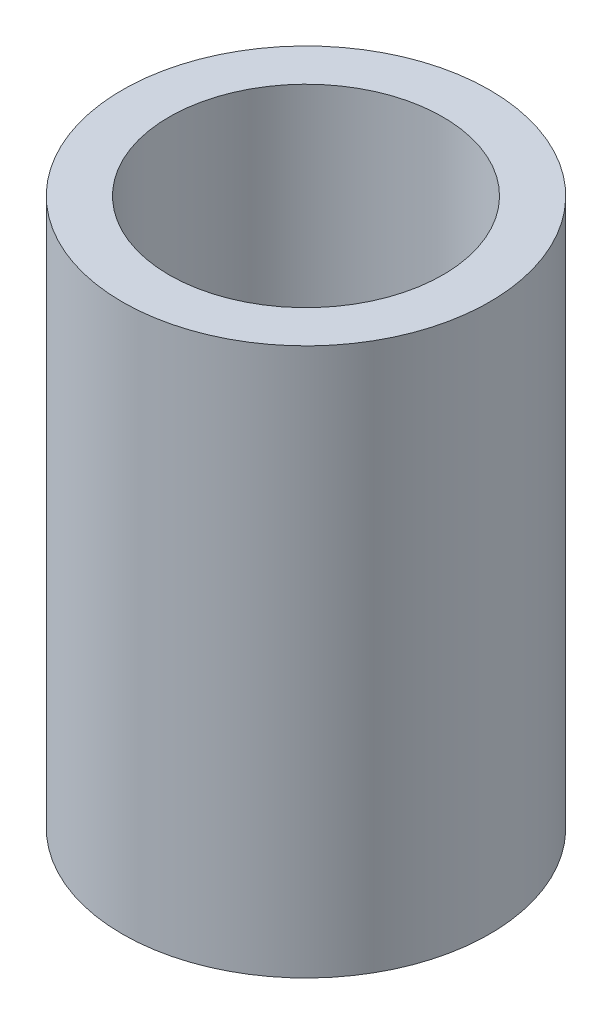
ISO-10303-21;
HEADER;
FILE_DESCRIPTION(('STEP AP214'),'2;1');
FILE_NAME('part.step','',(''),(''),'','','');
FILE_SCHEMA(('AUTOMOTIVE_DESIGN { 1 0 10303 214 1 1 1 1 }'));
ENDSEC;
DATA;
#1=APPLICATION_CONTEXT('core data for automotive mechanical design processes');
#2=APPLICATION_PROTOCOL_DEFINITION('international standard','automotive_design',2000,#1);
#3=PRODUCT_CONTEXT('',#1,'mechanical');
#4=PRODUCT('Part','Part','',(#3));
#5=PRODUCT_RELATED_PRODUCT_CATEGORY('part','',(#4));
#6=PRODUCT_DEFINITION_FORMATION('','',#4);
#7=PRODUCT_DEFINITION_CONTEXT('part definition',#1,'design');
#8=PRODUCT_DEFINITION('design','',#6,#7);
#9=PRODUCT_DEFINITION_SHAPE('','',#8);
#10=(LENGTH_UNIT() NAMED_UNIT(*) SI_UNIT(.MILLI.,.METRE.));
#11=(NAMED_UNIT(*) PLANE_ANGLE_UNIT() SI_UNIT($,.RADIAN.));
#12=(NAMED_UNIT(*) SI_UNIT($,.STERADIAN.) SOLID_ANGLE_UNIT());
#13=UNCERTAINTY_MEASURE_WITH_UNIT(LENGTH_MEASURE(1.E-05),#10,'distance_accuracy_value','');
#14=(GEOMETRIC_REPRESENTATION_CONTEXT(3) GLOBAL_UNCERTAINTY_ASSIGNED_CONTEXT((#13)) GLOBAL_UNIT_ASSIGNED_CONTEXT((#10,
#11,#12)) REPRESENTATION_CONTEXT('',''));
#15=CARTESIAN_POINT('',(0.,0.,0.));
#16=DIRECTION('',(0.,0.,1.));
#17=DIRECTION('',(1.,0.,0.));
#18=AXIS2_PLACEMENT_3D('',#15,#16,#17);
#19=CARTESIAN_POINT('',(0.,0.,0.));
#20=DIRECTION('',(0.,1.,0.));
#21=DIRECTION('',(0.,0.,1.));
#22=AXIS2_PLACEMENT_3D('',#19,#20,#21);
#23=CYLINDRICAL_SURFACE('',#22,38.1);
#24=CARTESIAN_POINT('',(0.,0.,0.));
#25=DIRECTION('',(0.,1.,0.));
#26=DIRECTION('',(0.,0.,1.));
#27=AXIS2_PLACEMENT_3D('',#24,#25,#26);
#28=CIRCLE('',#27,38.1);
#29=CARTESIAN_POINT('',(0.,0.,38.1));
#30=VERTEX_POINT('',#29);
#31=EDGE_CURVE('E45',#30,#30,#28,.T.);
#32=ORIENTED_EDGE('',*,*,#31,.T.);
#33=EDGE_LOOP('',(#32));
#34=FACE_BOUND('',#33,.T.);
#35=CARTESIAN_POINT('',(0.,-152.4,0.));
#36=DIRECTION('',(0.,1.,0.));
#37=DIRECTION('',(0.,0.,1.));
#38=AXIS2_PLACEMENT_3D('',#35,#36,#37);
#39=CIRCLE('',#38,38.1);
#40=CARTESIAN_POINT('',(0.,-152.4,38.1));
#41=VERTEX_POINT('',#40);
#42=EDGE_CURVE('E10',#41,#41,#39,.T.);
#43=ORIENTED_EDGE('',*,*,#42,.F.);
#44=EDGE_LOOP('',(#43));
#45=FACE_BOUND('',#44,.T.);
#46=ADVANCED_FACE('F31',(#34,#45),#23,.F.);
#47=CARTESIAN_POINT('',(-38.1,-152.4,0.));
#48=DIRECTION('',(0.,-1.,0.));
#49=DIRECTION('',(0.,0.,-1.));
#50=AXIS2_PLACEMENT_3D('',#47,#48,#49);
#51=PLANE('',#50);
#52=ORIENTED_EDGE('',*,*,#42,.T.);
#53=EDGE_LOOP('',(#52));
#54=FACE_BOUND('',#53,.T.);
#55=CARTESIAN_POINT('',(0.,-152.4,0.));
#56=DIRECTION('',(0.,1.,0.));
#57=DIRECTION('',(0.,0.,1.));
#58=AXIS2_PLACEMENT_3D('',#55,#56,#57);
#59=CIRCLE('',#58,51.1302);
#60=CARTESIAN_POINT('',(0.,-152.4,51.1302));
#61=VERTEX_POINT('',#60);
#62=EDGE_CURVE('E37',#61,#61,#59,.T.);
#63=ORIENTED_EDGE('',*,*,#62,.F.);
#64=EDGE_LOOP('',(#63));
#65=FACE_BOUND('',#64,.T.);
#66=ADVANCED_FACE('F61',(#54,#65),#51,.T.);
#67=CARTESIAN_POINT('',(0.,0.,0.));
#68=DIRECTION('',(0.,1.,0.));
#69=DIRECTION('',(0.,0.,1.));
#70=AXIS2_PLACEMENT_3D('',#67,#68,#69);
#71=CYLINDRICAL_SURFACE('',#70,51.1302);
#72=ORIENTED_EDGE('',*,*,#62,.T.);
#73=EDGE_LOOP('',(#72));
#74=FACE_BOUND('',#73,.T.);
#75=CARTESIAN_POINT('',(0.,0.,0.));
#76=DIRECTION('',(0.,1.,0.));
#77=DIRECTION('',(0.,0.,1.));
#78=AXIS2_PLACEMENT_3D('',#75,#76,#77);
#79=CIRCLE('',#78,51.1302);
#80=CARTESIAN_POINT('',(0.,0.,51.1302));
#81=VERTEX_POINT('',#80);
#82=EDGE_CURVE('E41',#81,#81,#79,.T.);
#83=ORIENTED_EDGE('',*,*,#82,.F.);
#84=EDGE_LOOP('',(#83));
#85=FACE_BOUND('',#84,.T.);
#86=ADVANCED_FACE('F55',(#74,#85),#71,.T.);
#87=CARTESIAN_POINT('',(-38.1,0.,0.));
#88=DIRECTION('',(0.,1.,0.));
#89=DIRECTION('',(0.,0.,1.));
#90=AXIS2_PLACEMENT_3D('',#87,#88,#89);
#91=PLANE('',#90);
#92=ORIENTED_EDGE('',*,*,#82,.T.);
#93=EDGE_LOOP('',(#92));
#94=FACE_BOUND('',#93,.T.);
#95=ORIENTED_EDGE('',*,*,#31,.F.);
#96=EDGE_LOOP('',(#95));
#97=FACE_BOUND('',#96,.T.);
#98=ADVANCED_FACE('F53',(#94,#97),#91,.T.);
#99=CLOSED_SHELL('',(#46,#66,#86,#98));
#100=MANIFOLD_SOLID_BREP('B2',#99);
#101=ADVANCED_BREP_SHAPE_REPRESENTATION('',(#18,#100),#14);
#102=SHAPE_DEFINITION_REPRESENTATION(#9,#101);
ENDSEC;
END-ISO-10303-21;
